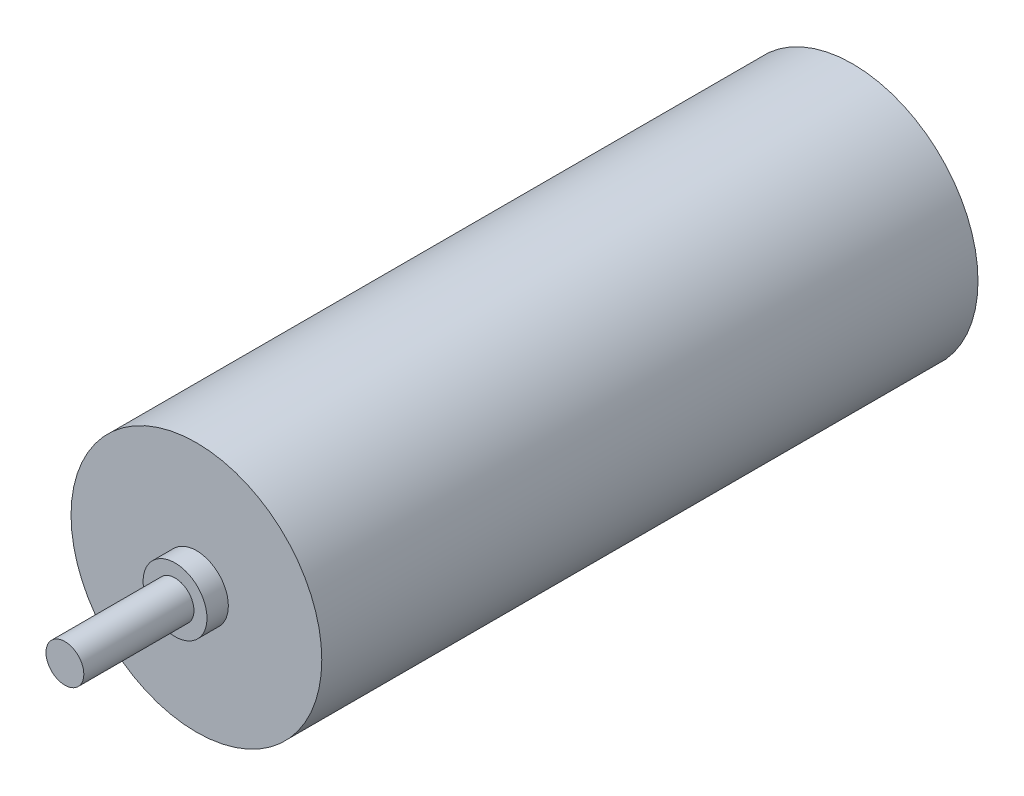
ISO-10303-21;
HEADER;
FILE_DESCRIPTION(('STEP AP214'),'2;1');
FILE_NAME('part.step','',(''),(''),'','','');
FILE_SCHEMA(('AUTOMOTIVE_DESIGN { 1 0 10303 214 1 1 1 1 }'));
ENDSEC;
DATA;
#1=APPLICATION_CONTEXT('core data for automotive mechanical design processes');
#2=APPLICATION_PROTOCOL_DEFINITION('international standard','automotive_design',2000,#1);
#3=PRODUCT_CONTEXT('',#1,'mechanical');
#4=PRODUCT('Part','Part','',(#3));
#5=PRODUCT_RELATED_PRODUCT_CATEGORY('part','',(#4));
#6=PRODUCT_DEFINITION_FORMATION('','',#4);
#7=PRODUCT_DEFINITION_CONTEXT('part definition',#1,'design');
#8=PRODUCT_DEFINITION('design','',#6,#7);
#9=PRODUCT_DEFINITION_SHAPE('','',#8);
#10=(LENGTH_UNIT() NAMED_UNIT(*) SI_UNIT(.MILLI.,.METRE.));
#11=(NAMED_UNIT(*) PLANE_ANGLE_UNIT() SI_UNIT($,.RADIAN.));
#12=(NAMED_UNIT(*) SI_UNIT($,.STERADIAN.) SOLID_ANGLE_UNIT());
#13=UNCERTAINTY_MEASURE_WITH_UNIT(LENGTH_MEASURE(1.E-05),#10,'distance_accuracy_value','');
#14=(GEOMETRIC_REPRESENTATION_CONTEXT(3) GLOBAL_UNCERTAINTY_ASSIGNED_CONTEXT((#13)) GLOBAL_UNIT_ASSIGNED_CONTEXT((#10,
#11,#12)) REPRESENTATION_CONTEXT('',''));
#15=CARTESIAN_POINT('',(0.,0.,0.));
#16=DIRECTION('',(0.,0.,1.));
#17=DIRECTION('',(1.,0.,0.));
#18=AXIS2_PLACEMENT_3D('',#15,#16,#17);
#19=CARTESIAN_POINT('',(0.,0.,69.35));
#20=DIRECTION('',(0.,0.,-1.));
#21=DIRECTION('',(-1.,0.,0.));
#22=AXIS2_PLACEMENT_3D('',#19,#20,#21);
#23=CYLINDRICAL_SURFACE('',#22,13.25);
#24=CARTESIAN_POINT('',(0.,0.,69.35));
#25=DIRECTION('',(0.,0.,1.));
#26=DIRECTION('',(1.,0.,0.));
#27=AXIS2_PLACEMENT_3D('',#24,#25,#26);
#28=CIRCLE('',#27,13.25);
#29=CARTESIAN_POINT('',(13.25,0.,69.35));
#30=VERTEX_POINT('',#29);
#31=EDGE_CURVE('E51',#30,#30,#28,.T.);
#32=ORIENTED_EDGE('',*,*,#31,.F.);
#33=EDGE_LOOP('',(#32));
#34=FACE_BOUND('',#33,.T.);
#35=CARTESIAN_POINT('',(0.,0.,0.));
#36=DIRECTION('',(0.,0.,1.));
#37=DIRECTION('',(1.,0.,0.));
#38=AXIS2_PLACEMENT_3D('',#35,#36,#37);
#39=CIRCLE('',#38,13.25);
#40=CARTESIAN_POINT('',(13.25,0.,0.));
#41=VERTEX_POINT('',#40);
#42=EDGE_CURVE('E40',#41,#41,#39,.T.);
#43=ORIENTED_EDGE('',*,*,#42,.T.);
#44=EDGE_LOOP('',(#43));
#45=FACE_BOUND('',#44,.T.);
#46=ADVANCED_FACE('F37',(#34,#45),#23,.T.);
#47=CARTESIAN_POINT('',(0.,0.,69.35));
#48=DIRECTION('',(0.,0.,1.));
#49=DIRECTION('',(1.,0.,0.));
#50=AXIS2_PLACEMENT_3D('',#47,#48,#49);
#51=PLANE('',#50);
#52=CARTESIAN_POINT('',(0.,0.,69.35));
#53=DIRECTION('',(0.,0.,1.));
#54=DIRECTION('',(1.,0.,0.));
#55=AXIS2_PLACEMENT_3D('',#52,#53,#54);
#56=CIRCLE('',#55,3.375);
#57=CARTESIAN_POINT('',(3.375,0.,69.35));
#58=VERTEX_POINT('',#57);
#59=EDGE_CURVE('E45',#58,#58,#56,.T.);
#60=ORIENTED_EDGE('',*,*,#59,.F.);
#61=EDGE_LOOP('',(#60));
#62=FACE_BOUND('',#61,.T.);
#63=ORIENTED_EDGE('',*,*,#31,.T.);
#64=EDGE_LOOP('',(#63));
#65=FACE_BOUND('',#64,.T.);
#66=ADVANCED_FACE('F71',(#62,#65),#51,.T.);
#67=CARTESIAN_POINT('',(0.,0.,0.));
#68=DIRECTION('',(0.,0.,1.));
#69=DIRECTION('',(1.,0.,0.));
#70=AXIS2_PLACEMENT_3D('',#67,#68,#69);
#71=PLANE('',#70);
#72=ORIENTED_EDGE('',*,*,#42,.F.);
#73=EDGE_LOOP('',(#72));
#74=FACE_BOUND('',#73,.T.);
#75=ADVANCED_FACE('F68',(#74),#71,.F.);
#76=CARTESIAN_POINT('',(0.,0.,71.61));
#77=DIRECTION('',(0.,0.,-1.));
#78=DIRECTION('',(-1.,0.,0.));
#79=AXIS2_PLACEMENT_3D('',#76,#77,#78);
#80=CYLINDRICAL_SURFACE('',#79,3.375);
#81=CARTESIAN_POINT('',(0.,0.,71.61));
#82=DIRECTION('',(0.,0.,1.));
#83=DIRECTION('',(1.,0.,0.));
#84=AXIS2_PLACEMENT_3D('',#81,#82,#83);
#85=CIRCLE('',#84,3.375);
#86=CARTESIAN_POINT('',(3.375,0.,71.61));
#87=VERTEX_POINT('',#86);
#88=EDGE_CURVE('E56',#87,#87,#85,.T.);
#89=ORIENTED_EDGE('',*,*,#88,.F.);
#90=EDGE_LOOP('',(#89));
#91=FACE_BOUND('',#90,.T.);
#92=ORIENTED_EDGE('',*,*,#59,.T.);
#93=EDGE_LOOP('',(#92));
#94=FACE_BOUND('',#93,.T.);
#95=ADVANCED_FACE('F70',(#91,#94),#80,.T.);
#96=CARTESIAN_POINT('',(0.,0.,71.61));
#97=DIRECTION('',(0.,0.,1.));
#98=DIRECTION('',(1.,0.,0.));
#99=AXIS2_PLACEMENT_3D('',#96,#97,#98);
#100=PLANE('',#99);
#101=CARTESIAN_POINT('',(0.,0.,71.61));
#102=DIRECTION('',(0.,0.,1.));
#103=DIRECTION('',(1.,0.,0.));
#104=AXIS2_PLACEMENT_3D('',#101,#102,#103);
#105=CIRCLE('',#104,2.);
#106=CARTESIAN_POINT('',(2.,0.,71.61));
#107=VERTEX_POINT('',#106);
#108=EDGE_CURVE('E10',#107,#107,#105,.T.);
#109=ORIENTED_EDGE('',*,*,#108,.F.);
#110=EDGE_LOOP('',(#109));
#111=FACE_BOUND('',#110,.T.);
#112=ORIENTED_EDGE('',*,*,#88,.T.);
#113=EDGE_LOOP('',(#112));
#114=FACE_BOUND('',#113,.T.);
#115=ADVANCED_FACE('F76',(#111,#114),#100,.T.);
#116=CARTESIAN_POINT('',(0.,0.,83.25));
#117=DIRECTION('',(0.,0.,-1.));
#118=DIRECTION('',(-1.,0.,0.));
#119=AXIS2_PLACEMENT_3D('',#116,#117,#118);
#120=CYLINDRICAL_SURFACE('',#119,2.);
#121=CARTESIAN_POINT('',(0.,0.,83.25));
#122=DIRECTION('',(0.,0.,1.));
#123=DIRECTION('',(1.,0.,0.));
#124=AXIS2_PLACEMENT_3D('',#121,#122,#123);
#125=CIRCLE('',#124,2.);
#126=CARTESIAN_POINT('',(2.,0.,83.25));
#127=VERTEX_POINT('',#126);
#128=EDGE_CURVE('E55',#127,#127,#125,.T.);
#129=ORIENTED_EDGE('',*,*,#128,.F.);
#130=EDGE_LOOP('',(#129));
#131=FACE_BOUND('',#130,.T.);
#132=ORIENTED_EDGE('',*,*,#108,.T.);
#133=EDGE_LOOP('',(#132));
#134=FACE_BOUND('',#133,.T.);
#135=ADVANCED_FACE('F106',(#131,#134),#120,.T.);
#136=CARTESIAN_POINT('',(0.,0.,83.25));
#137=DIRECTION('',(0.,0.,1.));
#138=DIRECTION('',(1.,0.,0.));
#139=AXIS2_PLACEMENT_3D('',#136,#137,#138);
#140=PLANE('',#139);
#141=ORIENTED_EDGE('',*,*,#128,.T.);
#142=EDGE_LOOP('',(#141));
#143=FACE_BOUND('',#142,.T.);
#144=ADVANCED_FACE('F114',(#143),#140,.T.);
#145=CLOSED_SHELL('',(#46,#66,#75,#95,#115,#135,#144));
#146=MANIFOLD_SOLID_BREP('B2',#145);
#147=ADVANCED_BREP_SHAPE_REPRESENTATION('',(#18,#146),#14);
#148=SHAPE_DEFINITION_REPRESENTATION(#9,#147);
ENDSEC;
END-ISO-10303-21;
